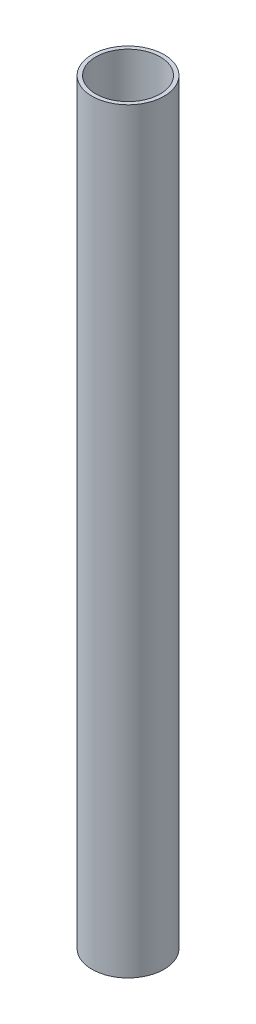
ISO-10303-21;
HEADER;
FILE_DESCRIPTION(('STEP AP214'),'2;1');
FILE_NAME('part.step','',(''),(''),'','','');
FILE_SCHEMA(('AUTOMOTIVE_DESIGN { 1 0 10303 214 1 1 1 1 }'));
ENDSEC;
DATA;
#1=APPLICATION_CONTEXT('core data for automotive mechanical design processes');
#2=APPLICATION_PROTOCOL_DEFINITION('international standard','automotive_design',2000,#1);
#3=PRODUCT_CONTEXT('',#1,'mechanical');
#4=PRODUCT('Part','Part','',(#3));
#5=PRODUCT_RELATED_PRODUCT_CATEGORY('part','',(#4));
#6=PRODUCT_DEFINITION_FORMATION('','',#4);
#7=PRODUCT_DEFINITION_CONTEXT('part definition',#1,'design');
#8=PRODUCT_DEFINITION('design','',#6,#7);
#9=PRODUCT_DEFINITION_SHAPE('','',#8);
#10=(LENGTH_UNIT() NAMED_UNIT(*) SI_UNIT(.MILLI.,.METRE.));
#11=(NAMED_UNIT(*) PLANE_ANGLE_UNIT() SI_UNIT($,.RADIAN.));
#12=(NAMED_UNIT(*) SI_UNIT($,.STERADIAN.) SOLID_ANGLE_UNIT());
#13=UNCERTAINTY_MEASURE_WITH_UNIT(LENGTH_MEASURE(1.E-05),#10,'distance_accuracy_value','');
#14=(GEOMETRIC_REPRESENTATION_CONTEXT(3) GLOBAL_UNCERTAINTY_ASSIGNED_CONTEXT((#13)) GLOBAL_UNIT_ASSIGNED_CONTEXT((#10,
#11,#12)) REPRESENTATION_CONTEXT('',''));
#15=CARTESIAN_POINT('',(0.,0.,0.));
#16=DIRECTION('',(0.,0.,1.));
#17=DIRECTION('',(1.,0.,0.));
#18=AXIS2_PLACEMENT_3D('',#15,#16,#17);
#19=CARTESIAN_POINT('',(-3.175,0.,0.));
#20=DIRECTION('',(0.,1.,0.));
#21=DIRECTION('',(0.,0.,1.));
#22=AXIS2_PLACEMENT_3D('',#19,#20,#21);
#23=PLANE('',#22);
#24=CARTESIAN_POINT('',(0.,0.,0.));
#25=DIRECTION('',(0.,-1.,0.));
#26=DIRECTION('',(0.,0.,-1.));
#27=AXIS2_PLACEMENT_3D('',#24,#25,#26);
#28=CIRCLE('',#27,3.175);
#29=CARTESIAN_POINT('',(0.,0.,-3.175));
#30=VERTEX_POINT('',#29);
#31=EDGE_CURVE('E54',#30,#30,#28,.T.);
#32=ORIENTED_EDGE('',*,*,#31,.F.);
#33=EDGE_LOOP('',(#32));
#34=FACE_BOUND('',#33,.T.);
#35=CARTESIAN_POINT('',(0.,0.,0.));
#36=DIRECTION('',(0.,-1.,0.));
#37=DIRECTION('',(0.,0.,-1.));
#38=AXIS2_PLACEMENT_3D('',#35,#36,#37);
#39=CIRCLE('',#38,3.556);
#40=CARTESIAN_POINT('',(0.,0.,-3.556));
#41=VERTEX_POINT('',#40);
#42=EDGE_CURVE('E10',#41,#41,#39,.T.);
#43=ORIENTED_EDGE('',*,*,#42,.T.);
#44=EDGE_LOOP('',(#43));
#45=FACE_BOUND('',#44,.T.);
#46=ADVANCED_FACE('F37',(#34,#45),#23,.F.);
#47=CARTESIAN_POINT('',(0.,0.,0.));
#48=DIRECTION('',(0.,-1.,0.));
#49=DIRECTION('',(0.,0.,-1.));
#50=AXIS2_PLACEMENT_3D('',#47,#48,#49);
#51=CYLINDRICAL_SURFACE('',#50,3.556);
#52=ORIENTED_EDGE('',*,*,#42,.F.);
#53=EDGE_LOOP('',(#52));
#54=FACE_BOUND('',#53,.T.);
#55=CARTESIAN_POINT('',(0.,74.6125,0.));
#56=DIRECTION('',(0.,-1.,0.));
#57=DIRECTION('',(0.,0.,-1.));
#58=AXIS2_PLACEMENT_3D('',#55,#56,#57);
#59=CIRCLE('',#58,3.556);
#60=CARTESIAN_POINT('',(0.,74.6125,-3.556));
#61=VERTEX_POINT('',#60);
#62=EDGE_CURVE('E44',#61,#61,#59,.T.);
#63=ORIENTED_EDGE('',*,*,#62,.T.);
#64=EDGE_LOOP('',(#63));
#65=FACE_BOUND('',#64,.T.);
#66=ADVANCED_FACE('F64',(#54,#65),#51,.T.);
#67=CARTESIAN_POINT('',(-3.556,74.6125,0.));
#68=DIRECTION('',(0.,-1.,0.));
#69=DIRECTION('',(0.,0.,-1.));
#70=AXIS2_PLACEMENT_3D('',#67,#68,#69);
#71=PLANE('',#70);
#72=ORIENTED_EDGE('',*,*,#62,.F.);
#73=EDGE_LOOP('',(#72));
#74=FACE_BOUND('',#73,.T.);
#75=CARTESIAN_POINT('',(0.,74.6125,0.));
#76=DIRECTION('',(0.,-1.,0.));
#77=DIRECTION('',(0.,0.,-1.));
#78=AXIS2_PLACEMENT_3D('',#75,#76,#77);
#79=CIRCLE('',#78,3.17500000000001);
#80=CARTESIAN_POINT('',(0.,74.6125,-3.17500000000001));
#81=VERTEX_POINT('',#80);
#82=EDGE_CURVE('E49',#81,#81,#79,.T.);
#83=ORIENTED_EDGE('',*,*,#82,.T.);
#84=EDGE_LOOP('',(#83));
#85=FACE_BOUND('',#84,.T.);
#86=ADVANCED_FACE('F68',(#74,#85),#71,.F.);
#87=CARTESIAN_POINT('',(0.,0.,0.));
#88=DIRECTION('',(0.,-1.,0.));
#89=DIRECTION('',(0.,0.,-1.));
#90=AXIS2_PLACEMENT_3D('',#87,#88,#89);
#91=CYLINDRICAL_SURFACE('',#90,3.175);
#92=ORIENTED_EDGE('',*,*,#82,.F.);
#93=EDGE_LOOP('',(#92));
#94=FACE_BOUND('',#93,.T.);
#95=ORIENTED_EDGE('',*,*,#31,.T.);
#96=EDGE_LOOP('',(#95));
#97=FACE_BOUND('',#96,.T.);
#98=ADVANCED_FACE('F61',(#94,#97),#91,.F.);
#99=CLOSED_SHELL('',(#46,#66,#86,#98));
#100=MANIFOLD_SOLID_BREP('B2',#99);
#101=ADVANCED_BREP_SHAPE_REPRESENTATION('',(#18,#100),#14);
#102=SHAPE_DEFINITION_REPRESENTATION(#9,#101);
ENDSEC;
END-ISO-10303-21;
